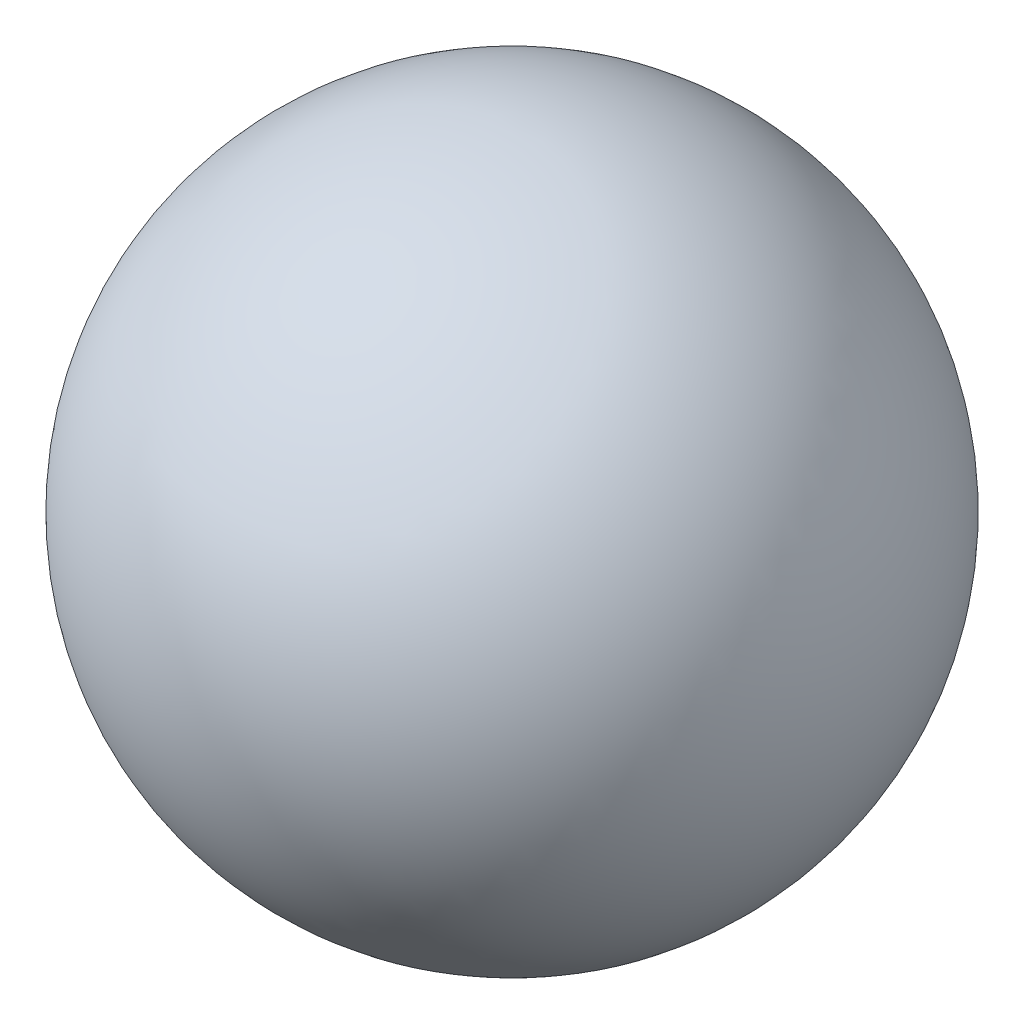
ISO-10303-21;
HEADER;
FILE_DESCRIPTION(('STEP AP214'),'2;1');
FILE_NAME('part.step','',(''),(''),'','','');
FILE_SCHEMA(('AUTOMOTIVE_DESIGN { 1 0 10303 214 1 1 1 1 }'));
ENDSEC;
DATA;
#1=APPLICATION_CONTEXT('core data for automotive mechanical design processes');
#2=APPLICATION_PROTOCOL_DEFINITION('international standard','automotive_design',2000,#1);
#3=PRODUCT_CONTEXT('',#1,'mechanical');
#4=PRODUCT('Part','Part','',(#3));
#5=PRODUCT_RELATED_PRODUCT_CATEGORY('part','',(#4));
#6=PRODUCT_DEFINITION_FORMATION('','',#4);
#7=PRODUCT_DEFINITION_CONTEXT('part definition',#1,'design');
#8=PRODUCT_DEFINITION('design','',#6,#7);
#9=PRODUCT_DEFINITION_SHAPE('','',#8);
#10=(LENGTH_UNIT() NAMED_UNIT(*) SI_UNIT(.MILLI.,.METRE.));
#11=(NAMED_UNIT(*) PLANE_ANGLE_UNIT() SI_UNIT($,.RADIAN.));
#12=(NAMED_UNIT(*) SI_UNIT($,.STERADIAN.) SOLID_ANGLE_UNIT());
#13=UNCERTAINTY_MEASURE_WITH_UNIT(LENGTH_MEASURE(1.E-05),#10,'distance_accuracy_value','');
#14=(GEOMETRIC_REPRESENTATION_CONTEXT(3) GLOBAL_UNCERTAINTY_ASSIGNED_CONTEXT((#13)) GLOBAL_UNIT_ASSIGNED_CONTEXT((#10,
#11,#12)) REPRESENTATION_CONTEXT('',''));
#15=CARTESIAN_POINT('',(0.,0.,0.));
#16=DIRECTION('',(0.,0.,1.));
#17=DIRECTION('',(1.,0.,0.));
#18=AXIS2_PLACEMENT_3D('',#15,#16,#17);
#19=CARTESIAN_POINT('',(0.,0.,0.));
#20=DIRECTION('',(0.,1.,0.));
#21=DIRECTION('',(1.,0.,0.));
#22=AXIS2_PLACEMENT_3D('',#19,#20,#21);
#23=SPHERICAL_SURFACE('',#22,900.);
#24=CARTESIAN_POINT('',(0.,900.,0.));
#25=VERTEX_POINT('',#24);
#26=VERTEX_LOOP('',#25);
#27=FACE_BOUND('',#26,.T.);
#28=ADVANCED_FACE('F42',(#27),#23,.T.);
#29=CLOSED_SHELL('',(#28));
#30=CARTESIAN_POINT('',(0.,900.,0.));
#31=DIRECTION('',(0.,1.,0.));
#32=DIRECTION('',(0.,0.,1.));
#33=AXIS2_PLACEMENT_3D('',#30,#31,#32);
#34=CYLINDRICAL_SURFACE('',#33,10.);
#35=CARTESIAN_POINT('',(0.,-889.94381845148,0.));
#36=DIRECTION('',(0.,1.,0.));
#37=DIRECTION('',(0.,0.,1.));
#38=AXIS2_PLACEMENT_3D('',#35,#36,#37);
#39=CIRCLE('',#38,10.);
#40=CARTESIAN_POINT('',(0.,-889.94381845148,10.));
#41=VERTEX_POINT('',#40);
#42=EDGE_CURVE('E10',#41,#41,#39,.T.);
#43=ORIENTED_EDGE('',*,*,#42,.T.);
#44=EDGE_LOOP('',(#43));
#45=FACE_BOUND('',#44,.T.);
#46=CARTESIAN_POINT('',(0.,889.94381845148,0.));
#47=DIRECTION('',(0.,1.,0.));
#48=DIRECTION('',(0.,0.,1.));
#49=AXIS2_PLACEMENT_3D('',#46,#47,#48);
#50=CIRCLE('',#49,10.);
#51=CARTESIAN_POINT('',(0.,889.94381845148,10.));
#52=VERTEX_POINT('',#51);
#53=EDGE_CURVE('E49',#52,#52,#50,.T.);
#54=ORIENTED_EDGE('',*,*,#53,.F.);
#55=EDGE_LOOP('',(#54));
#56=FACE_BOUND('',#55,.T.);
#57=ADVANCED_FACE('F59',(#45,#56),#34,.T.);
#58=CARTESIAN_POINT('',(0.,0.,0.));
#59=DIRECTION('',(0.,1.,0.));
#60=DIRECTION('',(1.,0.,0.));
#61=AXIS2_PLACEMENT_3D('',#58,#59,#60);
#62=SPHERICAL_SURFACE('',#61,890.);
#63=ORIENTED_EDGE('',*,*,#53,.T.);
#64=EDGE_LOOP('',(#63));
#65=FACE_BOUND('',#64,.T.);
#66=ORIENTED_EDGE('',*,*,#42,.F.);
#67=EDGE_LOOP('',(#66));
#68=FACE_BOUND('',#67,.T.);
#69=ADVANCED_FACE('F56',(#65,#68),#62,.F.);
#70=CLOSED_SHELL('',(#57,#69));
#71=ORIENTED_CLOSED_SHELL('',*,#70,.T.);
#72=BREP_WITH_VOIDS('B2',#29,(#71));
#73=ADVANCED_BREP_SHAPE_REPRESENTATION('',(#18,#72),#14);
#74=SHAPE_DEFINITION_REPRESENTATION(#9,#73);
ENDSEC;
END-ISO-10303-21;
